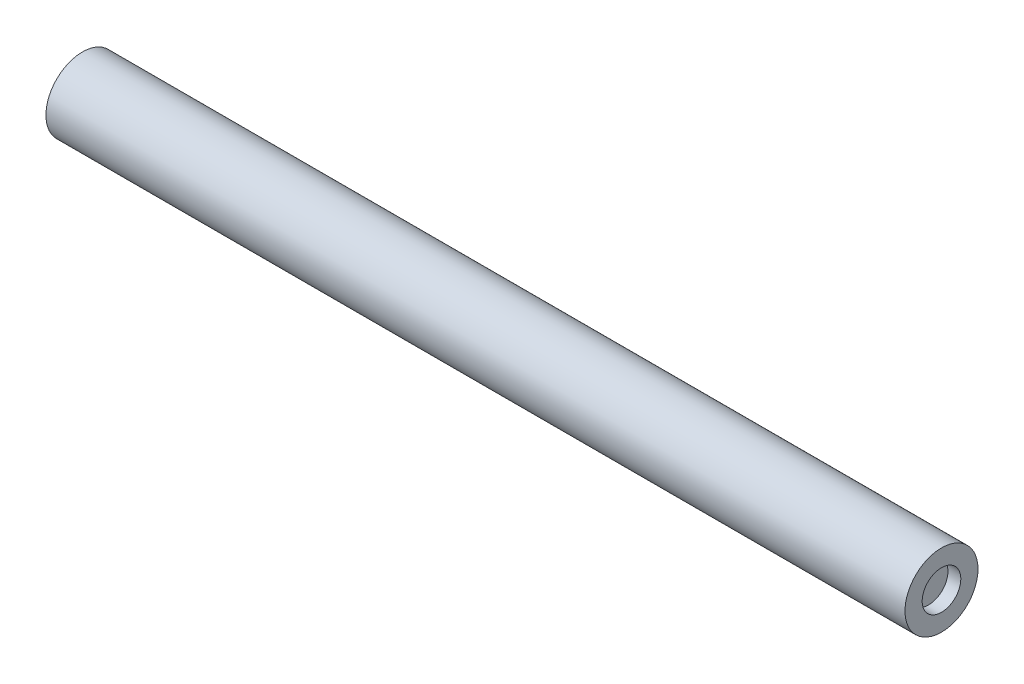
ISO-10303-21;
HEADER;
FILE_DESCRIPTION(('STEP AP214'),'2;1');
FILE_NAME('part.step','',(''),(''),'','','');
FILE_SCHEMA(('AUTOMOTIVE_DESIGN { 1 0 10303 214 1 1 1 1 }'));
ENDSEC;
DATA;
#1=APPLICATION_CONTEXT('core data for automotive mechanical design processes');
#2=APPLICATION_PROTOCOL_DEFINITION('international standard','automotive_design',2000,#1);
#3=PRODUCT_CONTEXT('',#1,'mechanical');
#4=PRODUCT('Part','Part','',(#3));
#5=PRODUCT_RELATED_PRODUCT_CATEGORY('part','',(#4));
#6=PRODUCT_DEFINITION_FORMATION('','',#4);
#7=PRODUCT_DEFINITION_CONTEXT('part definition',#1,'design');
#8=PRODUCT_DEFINITION('design','',#6,#7);
#9=PRODUCT_DEFINITION_SHAPE('','',#8);
#10=(LENGTH_UNIT() NAMED_UNIT(*) SI_UNIT(.MILLI.,.METRE.));
#11=(NAMED_UNIT(*) PLANE_ANGLE_UNIT() SI_UNIT($,.RADIAN.));
#12=(NAMED_UNIT(*) SI_UNIT($,.STERADIAN.) SOLID_ANGLE_UNIT());
#13=UNCERTAINTY_MEASURE_WITH_UNIT(LENGTH_MEASURE(1.E-05),#10,'distance_accuracy_value','');
#14=(GEOMETRIC_REPRESENTATION_CONTEXT(3) GLOBAL_UNCERTAINTY_ASSIGNED_CONTEXT((#13)) GLOBAL_UNIT_ASSIGNED_CONTEXT((#10,
#11,#12)) REPRESENTATION_CONTEXT('',''));
#15=CARTESIAN_POINT('',(0.,0.,0.));
#16=DIRECTION('',(0.,0.,1.));
#17=DIRECTION('',(1.,0.,0.));
#18=AXIS2_PLACEMENT_3D('',#15,#16,#17);
#19=CARTESIAN_POINT('',(203.2,0.,0.));
#20=DIRECTION('',(-1.,0.,0.));
#21=DIRECTION('',(0.,0.,1.));
#22=AXIS2_PLACEMENT_3D('',#19,#20,#21);
#23=CYLINDRICAL_SURFACE('',#22,8.636);
#24=CARTESIAN_POINT('',(203.2,0.,0.));
#25=DIRECTION('',(1.,0.,0.));
#26=DIRECTION('',(0.,0.,-1.));
#27=AXIS2_PLACEMENT_3D('',#24,#25,#26);
#28=CIRCLE('',#27,8.636);
#29=CARTESIAN_POINT('',(203.2,0.,-8.636));
#30=VERTEX_POINT('',#29);
#31=EDGE_CURVE('E10',#30,#30,#28,.T.);
#32=ORIENTED_EDGE('',*,*,#31,.F.);
#33=EDGE_LOOP('',(#32));
#34=FACE_BOUND('',#33,.T.);
#35=CARTESIAN_POINT('',(0.,0.,0.));
#36=DIRECTION('',(1.,0.,0.));
#37=DIRECTION('',(0.,0.,-1.));
#38=AXIS2_PLACEMENT_3D('',#35,#36,#37);
#39=CIRCLE('',#38,8.636);
#40=CARTESIAN_POINT('',(0.,0.,-8.636));
#41=VERTEX_POINT('',#40);
#42=EDGE_CURVE('E42',#41,#41,#39,.T.);
#43=ORIENTED_EDGE('',*,*,#42,.T.);
#44=EDGE_LOOP('',(#43));
#45=FACE_BOUND('',#44,.T.);
#46=ADVANCED_FACE('F39',(#34,#45),#23,.T.);
#47=CARTESIAN_POINT('',(203.2,0.,0.));
#48=DIRECTION('',(1.,0.,0.));
#49=DIRECTION('',(0.,0.,-1.));
#50=AXIS2_PLACEMENT_3D('',#47,#48,#49);
#51=PLANE('',#50);
#52=CARTESIAN_POINT('',(203.2,0.,0.));
#53=DIRECTION('',(1.,0.,0.));
#54=DIRECTION('',(0.,0.,-1.));
#55=AXIS2_PLACEMENT_3D('',#52,#53,#54);
#56=CIRCLE('',#55,4.572);
#57=CARTESIAN_POINT('',(203.2,0.,-4.572));
#58=VERTEX_POINT('',#57);
#59=EDGE_CURVE('E53',#58,#58,#56,.T.);
#60=ORIENTED_EDGE('',*,*,#59,.F.);
#61=EDGE_LOOP('',(#60));
#62=FACE_BOUND('',#61,.T.);
#63=ORIENTED_EDGE('',*,*,#31,.T.);
#64=EDGE_LOOP('',(#63));
#65=FACE_BOUND('',#64,.T.);
#66=ADVANCED_FACE('F82',(#62,#65),#51,.T.);
#67=CARTESIAN_POINT('',(0.,0.,0.));
#68=DIRECTION('',(1.,0.,0.));
#69=DIRECTION('',(0.,0.,-1.));
#70=AXIS2_PLACEMENT_3D('',#67,#68,#69);
#71=PLANE('',#70);
#72=CARTESIAN_POINT('',(0.,0.,0.));
#73=DIRECTION('',(-1.,0.,0.));
#74=DIRECTION('',(0.,0.,1.));
#75=AXIS2_PLACEMENT_3D('',#72,#73,#74);
#76=CIRCLE('',#75,2.794);
#77=CARTESIAN_POINT('',(0.,0.,2.794));
#78=VERTEX_POINT('',#77);
#79=EDGE_CURVE('E61',#78,#78,#76,.T.);
#80=ORIENTED_EDGE('',*,*,#79,.F.);
#81=EDGE_LOOP('',(#80));
#82=FACE_BOUND('',#81,.T.);
#83=ORIENTED_EDGE('',*,*,#42,.F.);
#84=EDGE_LOOP('',(#83));
#85=FACE_BOUND('',#84,.T.);
#86=ADVANCED_FACE('F78',(#82,#85),#71,.F.);
#87=CARTESIAN_POINT('',(200.152,0.,0.));
#88=DIRECTION('',(1.,0.,0.));
#89=DIRECTION('',(0.,0.,-1.));
#90=AXIS2_PLACEMENT_3D('',#87,#88,#89);
#91=CYLINDRICAL_SURFACE('',#90,4.572);
#92=CARTESIAN_POINT('',(200.152,0.,0.));
#93=DIRECTION('',(1.,0.,0.));
#94=DIRECTION('',(0.,0.,-1.));
#95=AXIS2_PLACEMENT_3D('',#92,#93,#94);
#96=CIRCLE('',#95,4.572);
#97=CARTESIAN_POINT('',(200.152,0.,-4.572));
#98=VERTEX_POINT('',#97);
#99=EDGE_CURVE('E51',#98,#98,#96,.T.);
#100=ORIENTED_EDGE('',*,*,#99,.F.);
#101=EDGE_LOOP('',(#100));
#102=FACE_BOUND('',#101,.T.);
#103=ORIENTED_EDGE('',*,*,#59,.T.);
#104=EDGE_LOOP('',(#103));
#105=FACE_BOUND('',#104,.T.);
#106=ADVANCED_FACE('F81',(#102,#105),#91,.F.);
#107=CARTESIAN_POINT('',(200.152,0.,0.));
#108=DIRECTION('',(1.,0.,0.));
#109=DIRECTION('',(0.,0.,-1.));
#110=AXIS2_PLACEMENT_3D('',#107,#108,#109);
#111=PLANE('',#110);
#112=ORIENTED_EDGE('',*,*,#99,.T.);
#113=EDGE_LOOP('',(#112));
#114=FACE_BOUND('',#113,.T.);
#115=ADVANCED_FACE('F74',(#114),#111,.T.);
#116=CARTESIAN_POINT('',(14.478,0.,0.));
#117=DIRECTION('',(-1.,0.,0.));
#118=DIRECTION('',(0.,0.,1.));
#119=AXIS2_PLACEMENT_3D('',#116,#117,#118);
#120=CYLINDRICAL_SURFACE('',#119,2.794);
#121=CARTESIAN_POINT('',(14.478,0.,0.));
#122=DIRECTION('',(-1.,0.,0.));
#123=DIRECTION('',(0.,0.,1.));
#124=AXIS2_PLACEMENT_3D('',#121,#122,#123);
#125=CIRCLE('',#124,2.794);
#126=CARTESIAN_POINT('',(14.478,0.,2.794));
#127=VERTEX_POINT('',#126);
#128=EDGE_CURVE('E57',#127,#127,#125,.T.);
#129=ORIENTED_EDGE('',*,*,#128,.F.);
#130=EDGE_LOOP('',(#129));
#131=FACE_BOUND('',#130,.T.);
#132=ORIENTED_EDGE('',*,*,#79,.T.);
#133=EDGE_LOOP('',(#132));
#134=FACE_BOUND('',#133,.T.);
#135=ADVANCED_FACE('F71',(#131,#134),#120,.F.);
#136=CARTESIAN_POINT('',(14.478,0.,0.));
#137=DIRECTION('',(-1.,0.,0.));
#138=DIRECTION('',(0.,0.,1.));
#139=AXIS2_PLACEMENT_3D('',#136,#137,#138);
#140=PLANE('',#139);
#141=ORIENTED_EDGE('',*,*,#128,.T.);
#142=EDGE_LOOP('',(#141));
#143=FACE_BOUND('',#142,.T.);
#144=ADVANCED_FACE('F69',(#143),#140,.T.);
#145=CLOSED_SHELL('',(#46,#66,#86,#106,#115,#135,#144));
#146=MANIFOLD_SOLID_BREP('B2',#145);
#147=ADVANCED_BREP_SHAPE_REPRESENTATION('',(#18,#146),#14);
#148=SHAPE_DEFINITION_REPRESENTATION(#9,#147);
ENDSEC;
END-ISO-10303-21;
